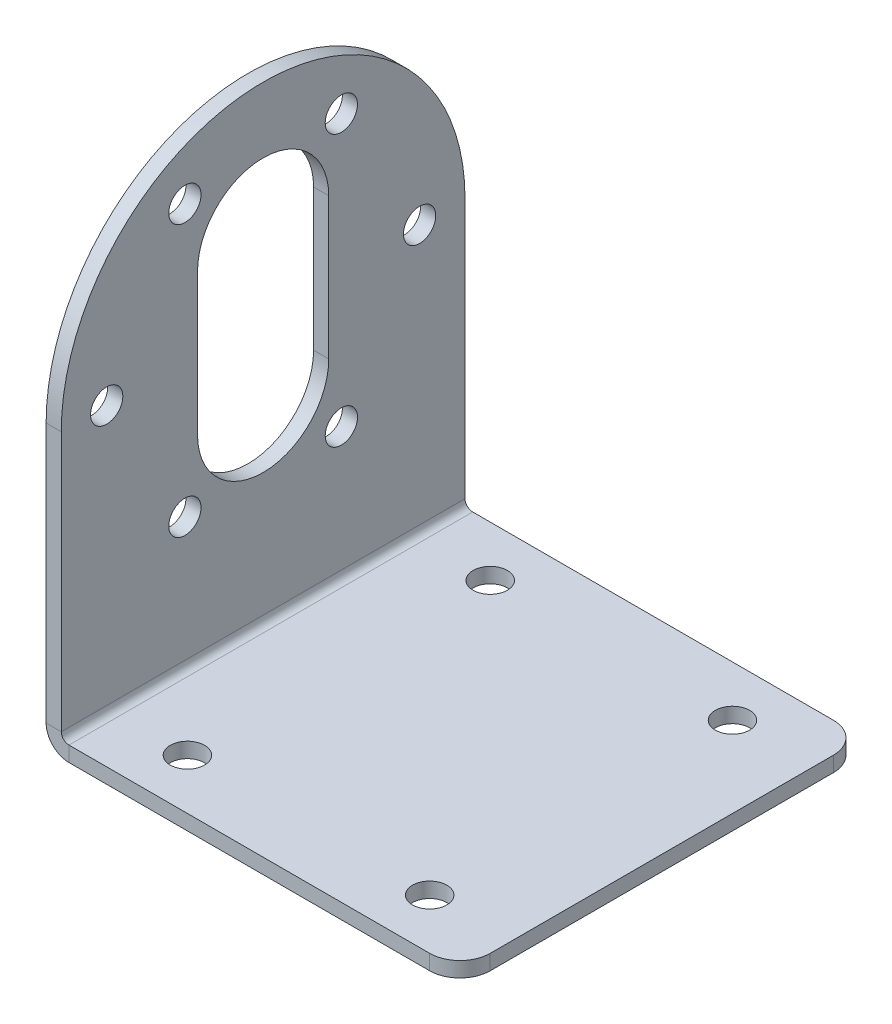
ISO-10303-21;
HEADER;
FILE_DESCRIPTION(('STEP AP214'),'2;1');
FILE_NAME('part.step','',(''),(''),'','','');
FILE_SCHEMA(('AUTOMOTIVE_DESIGN { 1 0 10303 214 1 1 1 1 }'));
ENDSEC;
DATA;
#1=APPLICATION_CONTEXT('core data for automotive mechanical design processes');
#2=APPLICATION_PROTOCOL_DEFINITION('international standard','automotive_design',2000,#1);
#3=PRODUCT_CONTEXT('',#1,'mechanical');
#4=PRODUCT('Part','Part','',(#3));
#5=PRODUCT_RELATED_PRODUCT_CATEGORY('part','',(#4));
#6=PRODUCT_DEFINITION_FORMATION('','',#4);
#7=PRODUCT_DEFINITION_CONTEXT('part definition',#1,'design');
#8=PRODUCT_DEFINITION('design','',#6,#7);
#9=PRODUCT_DEFINITION_SHAPE('','',#8);
#10=(LENGTH_UNIT() NAMED_UNIT(*) SI_UNIT(.MILLI.,.METRE.));
#11=(NAMED_UNIT(*) PLANE_ANGLE_UNIT() SI_UNIT($,.RADIAN.));
#12=(NAMED_UNIT(*) SI_UNIT($,.STERADIAN.) SOLID_ANGLE_UNIT());
#13=UNCERTAINTY_MEASURE_WITH_UNIT(LENGTH_MEASURE(1.E-05),#10,'distance_accuracy_value','');
#14=(GEOMETRIC_REPRESENTATION_CONTEXT(3) GLOBAL_UNCERTAINTY_ASSIGNED_CONTEXT((#13)) GLOBAL_UNIT_ASSIGNED_CONTEXT((#10,
#11,#12)) REPRESENTATION_CONTEXT('',''));
#15=CARTESIAN_POINT('',(0.,0.,0.));
#16=DIRECTION('',(0.,0.,1.));
#17=DIRECTION('',(1.,0.,0.));
#18=AXIS2_PLACEMENT_3D('',#15,#16,#17);
#19=CARTESIAN_POINT('',(0.,0.,0.));
#20=DIRECTION('',(1.,0.,0.));
#21=DIRECTION('',(0.,0.,-1.));
#22=AXIS2_PLACEMENT_3D('',#19,#20,#21);
#23=PLANE('',#22);
#24=DIRECTION('',(0.,-1.,0.));
#25=VECTOR('',#24,1.);
#26=CARTESIAN_POINT('',(0.,7.,-6.5));
#27=LINE('',#26,#25);
#28=CARTESIAN_POINT('',(0.,7.,-6.5));
#29=VERTEX_POINT('',#28);
#30=CARTESIAN_POINT('',(0.,-7.,-6.5));
#31=VERTEX_POINT('',#30);
#32=EDGE_CURVE('E155',#29,#31,#27,.T.);
#33=ORIENTED_EDGE('',*,*,#32,.F.);
#34=CARTESIAN_POINT('',(0.,7.,0.));
#35=DIRECTION('',(-1.,0.,0.));
#36=DIRECTION('',(0.,0.,1.));
#37=AXIS2_PLACEMENT_3D('',#34,#35,#36);
#38=CIRCLE('',#37,6.5);
#39=CARTESIAN_POINT('',(0.,7.,6.5));
#40=VERTEX_POINT('',#39);
#41=EDGE_CURVE('E160',#40,#29,#38,.T.);
#42=ORIENTED_EDGE('',*,*,#41,.F.);
#43=DIRECTION('',(0.,1.,0.));
#44=VECTOR('',#43,1.);
#45=CARTESIAN_POINT('',(0.,7.,6.5));
#46=LINE('',#45,#44);
#47=CARTESIAN_POINT('',(0.,-7.,6.5));
#48=VERTEX_POINT('',#47);
#49=EDGE_CURVE('E164',#48,#40,#46,.T.);
#50=ORIENTED_EDGE('',*,*,#49,.F.);
#51=CARTESIAN_POINT('',(0.,-7.,0.));
#52=DIRECTION('',(-1.,0.,0.));
#53=DIRECTION('',(0.,0.,1.));
#54=AXIS2_PLACEMENT_3D('',#51,#52,#53);
#55=CIRCLE('',#54,6.5);
#56=EDGE_CURVE('E144',#31,#48,#55,.T.);
#57=ORIENTED_EDGE('',*,*,#56,.F.);
#58=EDGE_LOOP('',(#33,#42,#50,#57));
#59=FACE_BOUND('',#58,.T.);
#60=CARTESIAN_POINT('',(0.,-13.4233937586589,7.74999999999988));
#61=DIRECTION('',(-1.,0.,0.));
#62=DIRECTION('',(0.,0.,1.));
#63=AXIS2_PLACEMENT_3D('',#60,#61,#62);
#64=CIRCLE('',#63,1.6);
#65=CARTESIAN_POINT('',(0.,-13.4233937586589,9.34999999999988));
#66=VERTEX_POINT('',#65);
#67=EDGE_CURVE('E179',#66,#66,#64,.T.);
#68=ORIENTED_EDGE('',*,*,#67,.F.);
#69=EDGE_LOOP('',(#68));
#70=FACE_BOUND('',#69,.T.);
#71=CARTESIAN_POINT('',(0.,13.4233937586588,7.75000000000006));
#72=DIRECTION('',(-1.,0.,0.));
#73=DIRECTION('',(0.,0.,1.));
#74=AXIS2_PLACEMENT_3D('',#71,#72,#73);
#75=CIRCLE('',#74,1.6);
#76=CARTESIAN_POINT('',(0.,13.4233937586588,9.35000000000006));
#77=VERTEX_POINT('',#76);
#78=EDGE_CURVE('E191',#77,#77,#75,.T.);
#79=ORIENTED_EDGE('',*,*,#78,.F.);
#80=EDGE_LOOP('',(#79));
#81=FACE_BOUND('',#80,.T.);
#82=CARTESIAN_POINT('',(0.,13.4233937586588,-7.74999999999997));
#83=DIRECTION('',(-1.,0.,0.));
#84=DIRECTION('',(0.,0.,1.));
#85=AXIS2_PLACEMENT_3D('',#82,#83,#84);
#86=CIRCLE('',#85,1.6);
#87=CARTESIAN_POINT('',(0.,13.4233937586588,-6.14999999999997));
#88=VERTEX_POINT('',#87);
#89=EDGE_CURVE('E197',#88,#88,#86,.T.);
#90=ORIENTED_EDGE('',*,*,#89,.F.);
#91=EDGE_LOOP('',(#90));
#92=FACE_BOUND('',#91,.T.);
#93=CARTESIAN_POINT('',(0.,0.,-15.5));
#94=DIRECTION('',(-1.,0.,0.));
#95=DIRECTION('',(0.,0.,1.));
#96=AXIS2_PLACEMENT_3D('',#93,#94,#95);
#97=CIRCLE('',#96,1.6);
#98=CARTESIAN_POINT('',(0.,0.,-13.9));
#99=VERTEX_POINT('',#98);
#100=EDGE_CURVE('E201',#99,#99,#97,.T.);
#101=ORIENTED_EDGE('',*,*,#100,.F.);
#102=EDGE_LOOP('',(#101));
#103=FACE_BOUND('',#102,.T.);
#104=DIRECTION('',(0.,1.,0.));
#105=VECTOR('',#104,1.);
#106=CARTESIAN_POINT('',(0.,0.,-20.));
#107=LINE('',#106,#105);
#108=CARTESIAN_POINT('',(0.,-25.738,-20.));
#109=VERTEX_POINT('',#108);
#110=CARTESIAN_POINT('',(0.,0.,-20.));
#111=VERTEX_POINT('',#110);
#112=EDGE_CURVE('E222',#109,#111,#107,.T.);
#113=ORIENTED_EDGE('',*,*,#112,.F.);
#114=DIRECTION('',(0.,0.,-1.));
#115=VECTOR('',#114,1.);
#116=CARTESIAN_POINT('',(0.,-25.738,0.));
#117=LINE('',#116,#115);
#118=CARTESIAN_POINT('',(0.,-25.738,20.));
#119=VERTEX_POINT('',#118);
#120=EDGE_CURVE('E228',#109,#119,#117,.F.);
#121=ORIENTED_EDGE('',*,*,#120,.T.);
#122=DIRECTION('',(0.,-1.,0.));
#123=VECTOR('',#122,1.);
#124=CARTESIAN_POINT('',(0.,0.,20.));
#125=LINE('',#124,#123);
#126=CARTESIAN_POINT('',(0.,0.,20.));
#127=VERTEX_POINT('',#126);
#128=EDGE_CURVE('E216',#127,#119,#125,.T.);
#129=ORIENTED_EDGE('',*,*,#128,.F.);
#130=CARTESIAN_POINT('',(0.,0.,0.));
#131=DIRECTION('',(1.,0.,0.));
#132=DIRECTION('',(0.,0.,-1.));
#133=AXIS2_PLACEMENT_3D('',#130,#131,#132);
#134=CIRCLE('',#133,20.);
#135=EDGE_CURVE('E219',#111,#127,#134,.T.);
#136=ORIENTED_EDGE('',*,*,#135,.F.);
#137=EDGE_LOOP('',(#113,#121,#129,#136));
#138=FACE_BOUND('',#137,.T.);
#139=CARTESIAN_POINT('',(0.,0.,15.5));
#140=DIRECTION('',(-1.,0.,0.));
#141=DIRECTION('',(0.,0.,1.));
#142=AXIS2_PLACEMENT_3D('',#139,#140,#141);
#143=CIRCLE('',#142,1.6);
#144=CARTESIAN_POINT('',(0.,0.,17.1));
#145=VERTEX_POINT('',#144);
#146=EDGE_CURVE('E185',#145,#145,#143,.T.);
#147=ORIENTED_EDGE('',*,*,#146,.F.);
#148=EDGE_LOOP('',(#147));
#149=FACE_BOUND('',#148,.T.);
#150=CARTESIAN_POINT('',(0.,-13.4233937586587,-7.75000000000016));
#151=DIRECTION('',(-1.,0.,0.));
#152=DIRECTION('',(0.,0.,1.));
#153=AXIS2_PLACEMENT_3D('',#150,#151,#152);
#154=CIRCLE('',#153,1.6);
#155=CARTESIAN_POINT('',(0.,-13.4233937586587,-6.15000000000016));
#156=VERTEX_POINT('',#155);
#157=EDGE_CURVE('E171',#156,#156,#154,.T.);
#158=ORIENTED_EDGE('',*,*,#157,.F.);
#159=EDGE_LOOP('',(#158));
#160=FACE_BOUND('',#159,.T.);
#161=ADVANCED_FACE('F38',(#59,#70,#81,#92,#103,#138,#149,#160),#23,.F.);
#162=CARTESIAN_POINT('',(1.5,-28.,-20.));
#163=DIRECTION('',(0.,0.,-1.));
#164=DIRECTION('',(-1.,0.,0.));
#165=AXIS2_PLACEMENT_3D('',#162,#163,#164);
#166=PLANE('',#165);
#167=DIRECTION('',(1.,0.,0.));
#168=VECTOR('',#167,1.);
#169=CARTESIAN_POINT('',(1.5,-26.5,-20.));
#170=LINE('',#169,#168);
#171=CARTESIAN_POINT('',(38.,-26.5,-20.));
#172=VERTEX_POINT('',#171);
#173=CARTESIAN_POINT('',(2.262,-26.5,-20.));
#174=VERTEX_POINT('',#173);
#175=EDGE_CURVE('E256',#172,#174,#170,.F.);
#176=ORIENTED_EDGE('',*,*,#175,.F.);
#177=DIRECTION('',(0.,1.,0.));
#178=VECTOR('',#177,1.);
#179=CARTESIAN_POINT('',(38.,-28.,-20.));
#180=LINE('',#179,#178);
#181=CARTESIAN_POINT('',(38.,-28.,-20.));
#182=VERTEX_POINT('',#181);
#183=EDGE_CURVE('E285',#172,#182,#180,.F.);
#184=ORIENTED_EDGE('',*,*,#183,.T.);
#185=DIRECTION('',(-1.,0.,0.));
#186=VECTOR('',#185,1.);
#187=CARTESIAN_POINT('',(1.5,-28.,-20.));
#188=LINE('',#187,#186);
#189=CARTESIAN_POINT('',(2.262,-28.,-20.));
#190=VERTEX_POINT('',#189);
#191=EDGE_CURVE('E208',#182,#190,#188,.T.);
#192=ORIENTED_EDGE('',*,*,#191,.T.);
#193=DIRECTION('',(0.,-1.,0.));
#194=VECTOR('',#193,1.);
#195=CARTESIAN_POINT('',(2.262,-28.,-20.));
#196=LINE('',#195,#194);
#197=EDGE_CURVE('E272',#174,#190,#196,.T.);
#198=ORIENTED_EDGE('',*,*,#197,.F.);
#199=EDGE_LOOP('',(#176,#184,#192,#198));
#200=FACE_BOUND('',#199,.T.);
#201=ADVANCED_FACE('F306',(#200),#166,.T.);
#202=CARTESIAN_POINT('',(41.,-28.,20.));
#203=DIRECTION('',(-1.,0.,0.));
#204=DIRECTION('',(0.,0.,1.));
#205=AXIS2_PLACEMENT_3D('',#202,#203,#204);
#206=PLANE('',#205);
#207=DIRECTION('',(0.,0.,1.));
#208=VECTOR('',#207,1.);
#209=CARTESIAN_POINT('',(41.,-28.,20.));
#210=LINE('',#209,#208);
#211=CARTESIAN_POINT('',(41.,-28.,-17.));
#212=VERTEX_POINT('',#211);
#213=CARTESIAN_POINT('',(41.,-28.,17.));
#214=VERTEX_POINT('',#213);
#215=EDGE_CURVE('E210',#212,#214,#210,.T.);
#216=ORIENTED_EDGE('',*,*,#215,.F.);
#217=DIRECTION('',(0.,-1.,0.));
#218=VECTOR('',#217,1.);
#219=CARTESIAN_POINT('',(41.,-28.,-17.));
#220=LINE('',#219,#218);
#221=CARTESIAN_POINT('',(41.,-26.5,-17.));
#222=VERTEX_POINT('',#221);
#223=EDGE_CURVE('E295',#212,#222,#220,.F.);
#224=ORIENTED_EDGE('',*,*,#223,.T.);
#225=DIRECTION('',(0.,0.,1.));
#226=VECTOR('',#225,1.);
#227=CARTESIAN_POINT('',(41.,-26.5,20.));
#228=LINE('',#227,#226);
#229=CARTESIAN_POINT('',(41.,-26.5,17.));
#230=VERTEX_POINT('',#229);
#231=EDGE_CURVE('E258',#222,#230,#228,.T.);
#232=ORIENTED_EDGE('',*,*,#231,.T.);
#233=DIRECTION('',(0.,1.,0.));
#234=VECTOR('',#233,1.);
#235=CARTESIAN_POINT('',(41.,-28.,17.));
#236=LINE('',#235,#234);
#237=EDGE_CURVE('E292',#230,#214,#236,.F.);
#238=ORIENTED_EDGE('',*,*,#237,.T.);
#239=EDGE_LOOP('',(#216,#224,#232,#238));
#240=FACE_BOUND('',#239,.T.);
#241=ADVANCED_FACE('F313',(#240),#206,.F.);
#242=CARTESIAN_POINT('',(1.5,-28.,20.));
#243=DIRECTION('',(0.,0.,-1.));
#244=DIRECTION('',(-1.,0.,0.));
#245=AXIS2_PLACEMENT_3D('',#242,#243,#244);
#246=PLANE('',#245);
#247=DIRECTION('',(-1.,0.,0.));
#248=VECTOR('',#247,1.);
#249=CARTESIAN_POINT('',(1.5,-28.,20.));
#250=LINE('',#249,#248);
#251=CARTESIAN_POINT('',(38.,-28.,20.));
#252=VERTEX_POINT('',#251);
#253=CARTESIAN_POINT('',(2.262,-28.,20.));
#254=VERTEX_POINT('',#253);
#255=EDGE_CURVE('E214',#252,#254,#250,.T.);
#256=ORIENTED_EDGE('',*,*,#255,.F.);
#257=DIRECTION('',(0.,1.,0.));
#258=VECTOR('',#257,1.);
#259=CARTESIAN_POINT('',(38.,-28.,20.));
#260=LINE('',#259,#258);
#261=CARTESIAN_POINT('',(38.,-26.5,20.));
#262=VERTEX_POINT('',#261);
#263=EDGE_CURVE('E11',#252,#262,#260,.T.);
#264=ORIENTED_EDGE('',*,*,#263,.T.);
#265=DIRECTION('',(1.,0.,0.));
#266=VECTOR('',#265,1.);
#267=CARTESIAN_POINT('',(1.5,-26.5,20.));
#268=LINE('',#267,#266);
#269=CARTESIAN_POINT('',(2.262,-26.5,20.));
#270=VERTEX_POINT('',#269);
#271=EDGE_CURVE('E252',#262,#270,#268,.F.);
#272=ORIENTED_EDGE('',*,*,#271,.T.);
#273=DIRECTION('',(0.,-1.,0.));
#274=VECTOR('',#273,1.);
#275=CARTESIAN_POINT('',(2.262,-28.,20.));
#276=LINE('',#275,#274);
#277=EDGE_CURVE('E269',#270,#254,#276,.T.);
#278=ORIENTED_EDGE('',*,*,#277,.T.);
#279=EDGE_LOOP('',(#256,#264,#272,#278));
#280=FACE_BOUND('',#279,.T.);
#281=ADVANCED_FACE('F316',(#280),#246,.F.);
#282=CARTESIAN_POINT('',(2.262,-25.738,20.));
#283=DIRECTION('',(0.,0.,1.));
#284=DIRECTION('',(0.,-1.,0.));
#285=AXIS2_PLACEMENT_3D('',#282,#283,#284);
#286=PLANE('',#285);
#287=ORIENTED_EDGE('',*,*,#277,.F.);
#288=CARTESIAN_POINT('',(2.262,-25.738,20.));
#289=DIRECTION('',(0.,0.,-1.));
#290=DIRECTION('',(-1.,0.,0.));
#291=AXIS2_PLACEMENT_3D('',#288,#289,#290);
#292=CIRCLE('',#291,0.762);
#293=CARTESIAN_POINT('',(1.5,-25.738,20.));
#294=VERTEX_POINT('',#293);
#295=EDGE_CURVE('E253',#270,#294,#292,.T.);
#296=ORIENTED_EDGE('',*,*,#295,.T.);
#297=DIRECTION('',(-1.,0.,0.));
#298=VECTOR('',#297,1.);
#299=CARTESIAN_POINT('',(0.,-25.738,20.));
#300=LINE('',#299,#298);
#301=EDGE_CURVE('E267',#294,#119,#300,.T.);
#302=ORIENTED_EDGE('',*,*,#301,.T.);
#303=CARTESIAN_POINT('',(2.262,-25.738,20.));
#304=DIRECTION('',(0.,0.,-1.));
#305=DIRECTION('',(0.,1.,0.));
#306=AXIS2_PLACEMENT_3D('',#303,#304,#305);
#307=CIRCLE('',#306,2.262);
#308=EDGE_CURVE('E211',#254,#119,#307,.T.);
#309=ORIENTED_EDGE('',*,*,#308,.F.);
#310=EDGE_LOOP('',(#287,#296,#302,#309));
#311=FACE_BOUND('',#310,.T.);
#312=ADVANCED_FACE('F321',(#311),#286,.T.);
#313=CARTESIAN_POINT('',(0.,0.,20.));
#314=DIRECTION('',(0.,0.,1.));
#315=DIRECTION('',(0.,-1.,0.));
#316=AXIS2_PLACEMENT_3D('',#313,#314,#315);
#317=PLANE('',#316);
#318=ORIENTED_EDGE('',*,*,#301,.F.);
#319=DIRECTION('',(0.,1.,0.));
#320=VECTOR('',#319,1.);
#321=CARTESIAN_POINT('',(1.5,0.,20.));
#322=LINE('',#321,#320);
#323=CARTESIAN_POINT('',(1.5,0.,20.));
#324=VERTEX_POINT('',#323);
#325=EDGE_CURVE('E249',#324,#294,#322,.F.);
#326=ORIENTED_EDGE('',*,*,#325,.F.);
#327=DIRECTION('',(-1.,0.,0.));
#328=VECTOR('',#327,1.);
#329=CARTESIAN_POINT('',(0.,0.,20.));
#330=LINE('',#329,#328);
#331=EDGE_CURVE('E265',#324,#127,#330,.T.);
#332=ORIENTED_EDGE('',*,*,#331,.T.);
#333=ORIENTED_EDGE('',*,*,#128,.T.);
#334=EDGE_LOOP('',(#318,#326,#332,#333));
#335=FACE_BOUND('',#334,.T.);
#336=ADVANCED_FACE('F504',(#335),#317,.T.);
#337=CARTESIAN_POINT('',(0.,0.,0.));
#338=DIRECTION('',(1.,0.,0.));
#339=DIRECTION('',(0.,0.,-1.));
#340=AXIS2_PLACEMENT_3D('',#337,#338,#339);
#341=CYLINDRICAL_SURFACE('',#340,20.);
#342=ORIENTED_EDGE('',*,*,#331,.F.);
#343=CARTESIAN_POINT('',(1.5,0.,0.));
#344=DIRECTION('',(1.,0.,0.));
#345=DIRECTION('',(0.,0.,-1.));
#346=AXIS2_PLACEMENT_3D('',#343,#344,#345);
#347=CIRCLE('',#346,20.);
#348=CARTESIAN_POINT('',(1.5,0.,-20.));
#349=VERTEX_POINT('',#348);
#350=EDGE_CURVE('E246',#349,#324,#347,.T.);
#351=ORIENTED_EDGE('',*,*,#350,.F.);
#352=DIRECTION('',(-1.,0.,0.));
#353=VECTOR('',#352,1.);
#354=CARTESIAN_POINT('',(0.,0.,-20.));
#355=LINE('',#354,#353);
#356=EDGE_CURVE('E263',#349,#111,#355,.T.);
#357=ORIENTED_EDGE('',*,*,#356,.T.);
#358=ORIENTED_EDGE('',*,*,#135,.T.);
#359=EDGE_LOOP('',(#342,#351,#357,#358));
#360=FACE_BOUND('',#359,.T.);
#361=ADVANCED_FACE('F496',(#360),#341,.T.);
#362=CARTESIAN_POINT('',(0.,0.,-20.));
#363=DIRECTION('',(0.,0.,-1.));
#364=DIRECTION('',(0.,1.,0.));
#365=AXIS2_PLACEMENT_3D('',#362,#363,#364);
#366=PLANE('',#365);
#367=ORIENTED_EDGE('',*,*,#356,.F.);
#368=DIRECTION('',(0.,1.,0.));
#369=VECTOR('',#368,1.);
#370=CARTESIAN_POINT('',(1.5,0.,-20.));
#371=LINE('',#370,#369);
#372=CARTESIAN_POINT('',(1.5,-25.738,-20.));
#373=VERTEX_POINT('',#372);
#374=EDGE_CURVE('E243',#373,#349,#371,.T.);
#375=ORIENTED_EDGE('',*,*,#374,.F.);
#376=DIRECTION('',(-1.,0.,0.));
#377=VECTOR('',#376,1.);
#378=CARTESIAN_POINT('',(0.,-25.738,-20.));
#379=LINE('',#378,#377);
#380=EDGE_CURVE('E231',#373,#109,#379,.T.);
#381=ORIENTED_EDGE('',*,*,#380,.T.);
#382=ORIENTED_EDGE('',*,*,#112,.T.);
#383=EDGE_LOOP('',(#367,#375,#381,#382));
#384=FACE_BOUND('',#383,.T.);
#385=ADVANCED_FACE('F335',(#384),#366,.T.);
#386=CARTESIAN_POINT('',(2.262,-25.738,-20.));
#387=DIRECTION('',(0.,0.,1.));
#388=DIRECTION('',(0.,-1.,0.));
#389=AXIS2_PLACEMENT_3D('',#386,#387,#388);
#390=PLANE('',#389);
#391=CARTESIAN_POINT('',(2.262,-25.738,-20.));
#392=DIRECTION('',(0.,0.,-1.));
#393=DIRECTION('',(-1.,0.,0.));
#394=AXIS2_PLACEMENT_3D('',#391,#392,#393);
#395=CIRCLE('',#394,0.762);
#396=EDGE_CURVE('E207',#373,#174,#395,.F.);
#397=ORIENTED_EDGE('',*,*,#396,.T.);
#398=ORIENTED_EDGE('',*,*,#197,.T.);
#399=CARTESIAN_POINT('',(2.262,-25.738,-20.));
#400=DIRECTION('',(0.,0.,-1.));
#401=DIRECTION('',(0.,1.,0.));
#402=AXIS2_PLACEMENT_3D('',#399,#400,#401);
#403=CIRCLE('',#402,2.262);
#404=EDGE_CURVE('E232',#109,#190,#403,.F.);
#405=ORIENTED_EDGE('',*,*,#404,.F.);
#406=ORIENTED_EDGE('',*,*,#380,.F.);
#407=EDGE_LOOP('',(#397,#398,#405,#406));
#408=FACE_BOUND('',#407,.T.);
#409=ADVANCED_FACE('F328',(#408),#390,.F.);
#410=CARTESIAN_POINT('',(1.5,-28.,20.));
#411=DIRECTION('',(0.,1.,0.));
#412=DIRECTION('',(0.,0.,1.));
#413=AXIS2_PLACEMENT_3D('',#410,#411,#412);
#414=PLANE('',#413);
#415=CARTESIAN_POINT('',(9.00000000000001,-28.,-15.));
#416=DIRECTION('',(0.,1.,0.));
#417=DIRECTION('',(0.,0.,1.));
#418=AXIS2_PLACEMENT_3D('',#415,#416,#417);
#419=CIRCLE('',#418,1.7);
#420=CARTESIAN_POINT('',(9.00000000000001,-28.,-13.3));
#421=VERTEX_POINT('',#420);
#422=EDGE_CURVE('E447',#421,#421,#419,.T.);
#423=ORIENTED_EDGE('',*,*,#422,.T.);
#424=EDGE_LOOP('',(#423));
#425=FACE_BOUND('',#424,.T.);
#426=CARTESIAN_POINT('',(9.00000000000001,-28.,15.));
#427=DIRECTION('',(0.,1.,0.));
#428=DIRECTION('',(0.,0.,1.));
#429=AXIS2_PLACEMENT_3D('',#426,#427,#428);
#430=CIRCLE('',#429,1.7);
#431=CARTESIAN_POINT('',(9.00000000000001,-28.,16.7));
#432=VERTEX_POINT('',#431);
#433=EDGE_CURVE('E451',#432,#432,#430,.T.);
#434=ORIENTED_EDGE('',*,*,#433,.T.);
#435=EDGE_LOOP('',(#434));
#436=FACE_BOUND('',#435,.T.);
#437=CARTESIAN_POINT('',(33.,-28.,15.));
#438=DIRECTION('',(0.,1.,0.));
#439=DIRECTION('',(0.,0.,1.));
#440=AXIS2_PLACEMENT_3D('',#437,#438,#439);
#441=CIRCLE('',#440,1.7);
#442=CARTESIAN_POINT('',(33.,-28.,16.7));
#443=VERTEX_POINT('',#442);
#444=EDGE_CURVE('E463',#443,#443,#441,.T.);
#445=ORIENTED_EDGE('',*,*,#444,.T.);
#446=EDGE_LOOP('',(#445));
#447=FACE_BOUND('',#446,.T.);
#448=CARTESIAN_POINT('',(33.,-28.,-15.));
#449=DIRECTION('',(0.,1.,0.));
#450=DIRECTION('',(0.,0.,1.));
#451=AXIS2_PLACEMENT_3D('',#448,#449,#450);
#452=CIRCLE('',#451,1.7);
#453=CARTESIAN_POINT('',(33.,-28.,-13.3));
#454=VERTEX_POINT('',#453);
#455=EDGE_CURVE('E469',#454,#454,#452,.T.);
#456=ORIENTED_EDGE('',*,*,#455,.T.);
#457=EDGE_LOOP('',(#456));
#458=FACE_BOUND('',#457,.T.);
#459=ORIENTED_EDGE('',*,*,#191,.F.);
#460=CARTESIAN_POINT('',(38.,-28.,-17.));
#461=DIRECTION('',(0.,1.,0.));
#462=DIRECTION('',(0.,0.,1.));
#463=AXIS2_PLACEMENT_3D('',#460,#461,#462);
#464=CIRCLE('',#463,3.);
#465=EDGE_CURVE('E290',#182,#212,#464,.F.);
#466=ORIENTED_EDGE('',*,*,#465,.T.);
#467=ORIENTED_EDGE('',*,*,#215,.T.);
#468=CARTESIAN_POINT('',(38.,-28.,17.));
#469=DIRECTION('',(0.,1.,0.));
#470=DIRECTION('',(0.,0.,1.));
#471=AXIS2_PLACEMENT_3D('',#468,#469,#470);
#472=CIRCLE('',#471,3.);
#473=EDGE_CURVE('E288',#214,#252,#472,.F.);
#474=ORIENTED_EDGE('',*,*,#473,.T.);
#475=ORIENTED_EDGE('',*,*,#255,.T.);
#476=DIRECTION('',(0.,0.,-1.));
#477=VECTOR('',#476,1.);
#478=CARTESIAN_POINT('',(2.262,-28.,20.));
#479=LINE('',#478,#477);
#480=EDGE_CURVE('E225',#254,#190,#479,.T.);
#481=ORIENTED_EDGE('',*,*,#480,.T.);
#482=EDGE_LOOP('',(#459,#466,#467,#474,#475,#481));
#483=FACE_BOUND('',#482,.T.);
#484=ADVANCED_FACE('F311',(#425,#436,#447,#458,#483),#414,.F.);
#485=CARTESIAN_POINT('',(2.262,-25.738,20.));
#486=DIRECTION('',(0.,0.,-1.));
#487=DIRECTION('',(-1.,0.,0.));
#488=AXIS2_PLACEMENT_3D('',#485,#486,#487);
#489=CYLINDRICAL_SURFACE('',#488,2.262);
#490=ORIENTED_EDGE('',*,*,#308,.T.);
#491=ORIENTED_EDGE('',*,*,#120,.F.);
#492=ORIENTED_EDGE('',*,*,#404,.T.);
#493=ORIENTED_EDGE('',*,*,#480,.F.);
#494=EDGE_LOOP('',(#490,#491,#492,#493));
#495=FACE_BOUND('',#494,.T.);
#496=ADVANCED_FACE('F324',(#495),#489,.T.);
#497=CARTESIAN_POINT('',(1.5,0.,0.));
#498=DIRECTION('',(1.,0.,0.));
#499=DIRECTION('',(0.,0.,-1.));
#500=AXIS2_PLACEMENT_3D('',#497,#498,#499);
#501=PLANE('',#500);
#502=CARTESIAN_POINT('',(1.5,7.,0.));
#503=DIRECTION('',(1.,0.,0.));
#504=DIRECTION('',(0.,0.,-1.));
#505=AXIS2_PLACEMENT_3D('',#502,#503,#504);
#506=CIRCLE('',#505,6.5);
#507=CARTESIAN_POINT('',(1.50000000000002,7.,-6.5));
#508=VERTEX_POINT('',#507);
#509=CARTESIAN_POINT('',(1.50000000000002,7.,6.5));
#510=VERTEX_POINT('',#509);
#511=EDGE_CURVE('E283',#508,#510,#506,.T.);
#512=ORIENTED_EDGE('',*,*,#511,.F.);
#513=DIRECTION('',(0.,1.,0.));
#514=VECTOR('',#513,1.);
#515=CARTESIAN_POINT('',(1.5,0.,-6.5));
#516=LINE('',#515,#514);
#517=CARTESIAN_POINT('',(1.5,-7.,-6.5));
#518=VERTEX_POINT('',#517);
#519=EDGE_CURVE('E275',#518,#508,#516,.T.);
#520=ORIENTED_EDGE('',*,*,#519,.F.);
#521=CARTESIAN_POINT('',(1.5,-7.,0.));
#522=DIRECTION('',(1.,0.,0.));
#523=DIRECTION('',(0.,0.,-1.));
#524=AXIS2_PLACEMENT_3D('',#521,#522,#523);
#525=CIRCLE('',#524,6.5);
#526=CARTESIAN_POINT('',(1.50000000000002,-7.,6.5));
#527=VERTEX_POINT('',#526);
#528=EDGE_CURVE('E147',#527,#518,#525,.T.);
#529=ORIENTED_EDGE('',*,*,#528,.F.);
#530=DIRECTION('',(0.,-1.,0.));
#531=VECTOR('',#530,1.);
#532=CARTESIAN_POINT('',(1.5,0.,6.5));
#533=LINE('',#532,#531);
#534=EDGE_CURVE('E281',#510,#527,#533,.T.);
#535=ORIENTED_EDGE('',*,*,#534,.F.);
#536=EDGE_LOOP('',(#512,#520,#529,#535));
#537=FACE_BOUND('',#536,.T.);
#538=CARTESIAN_POINT('',(1.5,-13.4233937586587,-7.75000000000016));
#539=DIRECTION('',(1.,0.,0.));
#540=DIRECTION('',(0.,0.,-1.));
#541=AXIS2_PLACEMENT_3D('',#538,#539,#540);
#542=CIRCLE('',#541,1.59999999999999);
#543=CARTESIAN_POINT('',(1.5,-13.4233937586587,-9.35000000000015));
#544=VERTEX_POINT('',#543);
#545=EDGE_CURVE('E176',#544,#544,#542,.T.);
#546=ORIENTED_EDGE('',*,*,#545,.F.);
#547=EDGE_LOOP('',(#546));
#548=FACE_BOUND('',#547,.T.);
#549=CARTESIAN_POINT('',(1.5,-13.4233937586589,7.74999999999988));
#550=DIRECTION('',(1.,0.,0.));
#551=DIRECTION('',(0.,0.,-1.));
#552=AXIS2_PLACEMENT_3D('',#549,#550,#551);
#553=CIRCLE('',#552,1.59999999999999);
#554=CARTESIAN_POINT('',(1.5,-13.4233937586589,6.14999999999988));
#555=VERTEX_POINT('',#554);
#556=EDGE_CURVE('E182',#555,#555,#553,.T.);
#557=ORIENTED_EDGE('',*,*,#556,.F.);
#558=EDGE_LOOP('',(#557));
#559=FACE_BOUND('',#558,.T.);
#560=CARTESIAN_POINT('',(1.5,0.,15.5));
#561=DIRECTION('',(1.,0.,0.));
#562=DIRECTION('',(0.,0.,-1.));
#563=AXIS2_PLACEMENT_3D('',#560,#561,#562);
#564=CIRCLE('',#563,1.59999999999999);
#565=CARTESIAN_POINT('',(1.5,0.,13.9));
#566=VERTEX_POINT('',#565);
#567=EDGE_CURVE('E188',#566,#566,#564,.T.);
#568=ORIENTED_EDGE('',*,*,#567,.F.);
#569=EDGE_LOOP('',(#568));
#570=FACE_BOUND('',#569,.T.);
#571=CARTESIAN_POINT('',(1.5,13.4233937586588,7.75000000000006));
#572=DIRECTION('',(1.,0.,0.));
#573=DIRECTION('',(0.,0.,-1.));
#574=AXIS2_PLACEMENT_3D('',#571,#572,#573);
#575=CIRCLE('',#574,1.59999999999999);
#576=CARTESIAN_POINT('',(1.5,13.4233937586588,6.15000000000007));
#577=VERTEX_POINT('',#576);
#578=EDGE_CURVE('E194',#577,#577,#575,.T.);
#579=ORIENTED_EDGE('',*,*,#578,.F.);
#580=EDGE_LOOP('',(#579));
#581=FACE_BOUND('',#580,.T.);
#582=CARTESIAN_POINT('',(1.5,13.4233937586588,-7.74999999999997));
#583=DIRECTION('',(1.,0.,0.));
#584=DIRECTION('',(0.,0.,-1.));
#585=AXIS2_PLACEMENT_3D('',#582,#583,#584);
#586=CIRCLE('',#585,1.59999999999999);
#587=CARTESIAN_POINT('',(1.5,13.4233937586588,-9.34999999999996));
#588=VERTEX_POINT('',#587);
#589=EDGE_CURVE('E200',#588,#588,#586,.T.);
#590=ORIENTED_EDGE('',*,*,#589,.F.);
#591=EDGE_LOOP('',(#590));
#592=FACE_BOUND('',#591,.T.);
#593=CARTESIAN_POINT('',(1.5,0.,-15.5));
#594=DIRECTION('',(1.,0.,0.));
#595=DIRECTION('',(0.,0.,-1.));
#596=AXIS2_PLACEMENT_3D('',#593,#594,#595);
#597=CIRCLE('',#596,1.59999999999999);
#598=CARTESIAN_POINT('',(1.5,0.,-17.1));
#599=VERTEX_POINT('',#598);
#600=EDGE_CURVE('E204',#599,#599,#597,.T.);
#601=ORIENTED_EDGE('',*,*,#600,.F.);
#602=EDGE_LOOP('',(#601));
#603=FACE_BOUND('',#602,.T.);
#604=ORIENTED_EDGE('',*,*,#374,.T.);
#605=ORIENTED_EDGE('',*,*,#350,.T.);
#606=ORIENTED_EDGE('',*,*,#325,.T.);
#607=DIRECTION('',(0.,0.,-1.));
#608=VECTOR('',#607,1.);
#609=CARTESIAN_POINT('',(1.5,-25.738,0.));
#610=LINE('',#609,#608);
#611=EDGE_CURVE('E235',#373,#294,#610,.F.);
#612=ORIENTED_EDGE('',*,*,#611,.F.);
#613=EDGE_LOOP('',(#604,#605,#606,#612));
#614=FACE_BOUND('',#613,.T.);
#615=ADVANCED_FACE('F339',(#537,#548,#559,#570,#581,#592,#603,#614),#501,.T.);
#616=CARTESIAN_POINT('',(1.5,-26.5,20.));
#617=DIRECTION('',(0.,1.,0.));
#618=DIRECTION('',(0.,0.,1.));
#619=AXIS2_PLACEMENT_3D('',#616,#617,#618);
#620=PLANE('',#619);
#621=CARTESIAN_POINT('',(9.00000000000001,-26.5,-15.));
#622=DIRECTION('',(0.,1.,0.));
#623=DIRECTION('',(0.,0.,1.));
#624=AXIS2_PLACEMENT_3D('',#621,#622,#623);
#625=CIRCLE('',#624,1.7);
#626=CARTESIAN_POINT('',(9.00000000000001,-26.5,-13.3));
#627=VERTEX_POINT('',#626);
#628=EDGE_CURVE('E450',#627,#627,#625,.T.);
#629=ORIENTED_EDGE('',*,*,#628,.F.);
#630=EDGE_LOOP('',(#629));
#631=FACE_BOUND('',#630,.T.);
#632=CARTESIAN_POINT('',(9.00000000000001,-26.5,15.));
#633=DIRECTION('',(0.,1.,0.));
#634=DIRECTION('',(0.,0.,1.));
#635=AXIS2_PLACEMENT_3D('',#632,#633,#634);
#636=CIRCLE('',#635,1.7);
#637=CARTESIAN_POINT('',(9.00000000000001,-26.5,16.7));
#638=VERTEX_POINT('',#637);
#639=EDGE_CURVE('E454',#638,#638,#636,.T.);
#640=ORIENTED_EDGE('',*,*,#639,.F.);
#641=EDGE_LOOP('',(#640));
#642=FACE_BOUND('',#641,.T.);
#643=CARTESIAN_POINT('',(33.,-26.5,15.));
#644=DIRECTION('',(0.,1.,0.));
#645=DIRECTION('',(0.,0.,1.));
#646=AXIS2_PLACEMENT_3D('',#643,#644,#645);
#647=CIRCLE('',#646,1.7);
#648=CARTESIAN_POINT('',(33.,-26.5,16.7));
#649=VERTEX_POINT('',#648);
#650=EDGE_CURVE('E460',#649,#649,#647,.T.);
#651=ORIENTED_EDGE('',*,*,#650,.F.);
#652=EDGE_LOOP('',(#651));
#653=FACE_BOUND('',#652,.T.);
#654=CARTESIAN_POINT('',(33.,-26.5,-15.));
#655=DIRECTION('',(0.,1.,0.));
#656=DIRECTION('',(0.,0.,1.));
#657=AXIS2_PLACEMENT_3D('',#654,#655,#656);
#658=CIRCLE('',#657,1.7);
#659=CARTESIAN_POINT('',(33.,-26.5,-13.3));
#660=VERTEX_POINT('',#659);
#661=EDGE_CURVE('E466',#660,#660,#658,.T.);
#662=ORIENTED_EDGE('',*,*,#661,.F.);
#663=EDGE_LOOP('',(#662));
#664=FACE_BOUND('',#663,.T.);
#665=ORIENTED_EDGE('',*,*,#231,.F.);
#666=CARTESIAN_POINT('',(38.,-26.5,-17.));
#667=DIRECTION('',(0.,1.,0.));
#668=DIRECTION('',(0.,0.,1.));
#669=AXIS2_PLACEMENT_3D('',#666,#667,#668);
#670=CIRCLE('',#669,3.);
#671=EDGE_CURVE('E46',#222,#172,#670,.T.);
#672=ORIENTED_EDGE('',*,*,#671,.T.);
#673=ORIENTED_EDGE('',*,*,#175,.T.);
#674=DIRECTION('',(0.,0.,1.));
#675=VECTOR('',#674,1.);
#676=CARTESIAN_POINT('',(2.262,-26.5,20.));
#677=LINE('',#676,#675);
#678=EDGE_CURVE('E240',#270,#174,#677,.F.);
#679=ORIENTED_EDGE('',*,*,#678,.F.);
#680=ORIENTED_EDGE('',*,*,#271,.F.);
#681=CARTESIAN_POINT('',(38.,-26.5,17.));
#682=DIRECTION('',(0.,1.,0.));
#683=DIRECTION('',(0.,0.,1.));
#684=AXIS2_PLACEMENT_3D('',#681,#682,#683);
#685=CIRCLE('',#684,3.);
#686=EDGE_CURVE('E58',#262,#230,#685,.T.);
#687=ORIENTED_EDGE('',*,*,#686,.T.);
#688=EDGE_LOOP('',(#665,#672,#673,#679,#680,#687));
#689=FACE_BOUND('',#688,.T.);
#690=ADVANCED_FACE('F299',(#631,#642,#653,#664,#689),#620,.T.);
#691=CARTESIAN_POINT('',(2.262,-25.738,20.));
#692=DIRECTION('',(0.,0.,-1.));
#693=DIRECTION('',(-1.,0.,0.));
#694=AXIS2_PLACEMENT_3D('',#691,#692,#693);
#695=CYLINDRICAL_SURFACE('',#694,0.762);
#696=ORIENTED_EDGE('',*,*,#295,.F.);
#697=ORIENTED_EDGE('',*,*,#678,.T.);
#698=ORIENTED_EDGE('',*,*,#396,.F.);
#699=ORIENTED_EDGE('',*,*,#611,.T.);
#700=EDGE_LOOP('',(#696,#697,#698,#699));
#701=FACE_BOUND('',#700,.T.);
#702=ADVANCED_FACE('F344',(#701),#695,.F.);
#703=CARTESIAN_POINT('',(0.,0.,-15.5));
#704=DIRECTION('',(-1.,0.,0.));
#705=DIRECTION('',(0.,0.,1.));
#706=AXIS2_PLACEMENT_3D('',#703,#704,#705);
#707=CYLINDRICAL_SURFACE('',#706,1.59999999999999);
#708=ORIENTED_EDGE('',*,*,#600,.T.);
#709=EDGE_LOOP('',(#708));
#710=FACE_BOUND('',#709,.T.);
#711=ORIENTED_EDGE('',*,*,#100,.T.);
#712=EDGE_LOOP('',(#711));
#713=FACE_BOUND('',#712,.T.);
#714=ADVANCED_FACE('F346',(#710,#713),#707,.F.);
#715=CARTESIAN_POINT('',(0.,13.4233937586588,-7.74999999999997));
#716=DIRECTION('',(-1.,0.,0.));
#717=DIRECTION('',(0.,0.,1.));
#718=AXIS2_PLACEMENT_3D('',#715,#716,#717);
#719=CYLINDRICAL_SURFACE('',#718,1.59999999999999);
#720=ORIENTED_EDGE('',*,*,#589,.T.);
#721=EDGE_LOOP('',(#720));
#722=FACE_BOUND('',#721,.T.);
#723=ORIENTED_EDGE('',*,*,#89,.T.);
#724=EDGE_LOOP('',(#723));
#725=FACE_BOUND('',#724,.T.);
#726=ADVANCED_FACE('F352',(#722,#725),#719,.F.);
#727=CARTESIAN_POINT('',(0.,13.4233937586588,7.75000000000006));
#728=DIRECTION('',(-1.,0.,0.));
#729=DIRECTION('',(0.,0.,1.));
#730=AXIS2_PLACEMENT_3D('',#727,#728,#729);
#731=CYLINDRICAL_SURFACE('',#730,1.59999999999999);
#732=ORIENTED_EDGE('',*,*,#578,.T.);
#733=EDGE_LOOP('',(#732));
#734=FACE_BOUND('',#733,.T.);
#735=ORIENTED_EDGE('',*,*,#78,.T.);
#736=EDGE_LOOP('',(#735));
#737=FACE_BOUND('',#736,.T.);
#738=ADVANCED_FACE('F392',(#734,#737),#731,.F.);
#739=CARTESIAN_POINT('',(0.,0.,15.5));
#740=DIRECTION('',(-1.,0.,0.));
#741=DIRECTION('',(0.,0.,1.));
#742=AXIS2_PLACEMENT_3D('',#739,#740,#741);
#743=CYLINDRICAL_SURFACE('',#742,1.59999999999999);
#744=ORIENTED_EDGE('',*,*,#567,.T.);
#745=EDGE_LOOP('',(#744));
#746=FACE_BOUND('',#745,.T.);
#747=ORIENTED_EDGE('',*,*,#146,.T.);
#748=EDGE_LOOP('',(#747));
#749=FACE_BOUND('',#748,.T.);
#750=ADVANCED_FACE('F399',(#746,#749),#743,.F.);
#751=CARTESIAN_POINT('',(0.,-13.4233937586589,7.74999999999988));
#752=DIRECTION('',(-1.,0.,0.));
#753=DIRECTION('',(0.,0.,1.));
#754=AXIS2_PLACEMENT_3D('',#751,#752,#753);
#755=CYLINDRICAL_SURFACE('',#754,1.59999999999999);
#756=ORIENTED_EDGE('',*,*,#556,.T.);
#757=EDGE_LOOP('',(#756));
#758=FACE_BOUND('',#757,.T.);
#759=ORIENTED_EDGE('',*,*,#67,.T.);
#760=EDGE_LOOP('',(#759));
#761=FACE_BOUND('',#760,.T.);
#762=ADVANCED_FACE('F405',(#758,#761),#755,.F.);
#763=CARTESIAN_POINT('',(0.,-13.4233937586587,-7.75000000000016));
#764=DIRECTION('',(-1.,0.,0.));
#765=DIRECTION('',(0.,0.,1.));
#766=AXIS2_PLACEMENT_3D('',#763,#764,#765);
#767=CYLINDRICAL_SURFACE('',#766,1.59999999999999);
#768=ORIENTED_EDGE('',*,*,#545,.T.);
#769=EDGE_LOOP('',(#768));
#770=FACE_BOUND('',#769,.T.);
#771=ORIENTED_EDGE('',*,*,#157,.T.);
#772=EDGE_LOOP('',(#771));
#773=FACE_BOUND('',#772,.T.);
#774=ADVANCED_FACE('F409',(#770,#773),#767,.F.);
#775=CARTESIAN_POINT('',(41.,7.,0.));
#776=DIRECTION('',(-1.,0.,0.));
#777=DIRECTION('',(0.,0.,1.));
#778=AXIS2_PLACEMENT_3D('',#775,#776,#777);
#779=CYLINDRICAL_SURFACE('',#778,6.5);
#780=ORIENTED_EDGE('',*,*,#511,.T.);
#781=DIRECTION('',(-1.,0.,0.));
#782=VECTOR('',#781,1.);
#783=CARTESIAN_POINT('',(41.,7.,6.5));
#784=LINE('',#783,#782);
#785=EDGE_CURVE('E169',#510,#40,#784,.T.);
#786=ORIENTED_EDGE('',*,*,#785,.T.);
#787=ORIENTED_EDGE('',*,*,#41,.T.);
#788=DIRECTION('',(-1.,0.,0.));
#789=VECTOR('',#788,1.);
#790=CARTESIAN_POINT('',(41.,7.,-6.5));
#791=LINE('',#790,#789);
#792=EDGE_CURVE('E151',#508,#29,#791,.T.);
#793=ORIENTED_EDGE('',*,*,#792,.F.);
#794=EDGE_LOOP('',(#780,#786,#787,#793));
#795=FACE_BOUND('',#794,.T.);
#796=ADVANCED_FACE('F413',(#795),#779,.F.);
#797=CARTESIAN_POINT('',(41.,7.,6.5));
#798=DIRECTION('',(0.,0.,1.));
#799=DIRECTION('',(0.,-1.,0.));
#800=AXIS2_PLACEMENT_3D('',#797,#798,#799);
#801=PLANE('',#800);
#802=ORIENTED_EDGE('',*,*,#534,.T.);
#803=DIRECTION('',(-1.,0.,0.));
#804=VECTOR('',#803,1.);
#805=CARTESIAN_POINT('',(41.,-7.,6.5));
#806=LINE('',#805,#804);
#807=EDGE_CURVE('E150',#527,#48,#806,.T.);
#808=ORIENTED_EDGE('',*,*,#807,.T.);
#809=ORIENTED_EDGE('',*,*,#49,.T.);
#810=ORIENTED_EDGE('',*,*,#785,.F.);
#811=EDGE_LOOP('',(#802,#808,#809,#810));
#812=FACE_BOUND('',#811,.T.);
#813=ADVANCED_FACE('F417',(#812),#801,.F.);
#814=CARTESIAN_POINT('',(41.,-7.,0.));
#815=DIRECTION('',(-1.,0.,0.));
#816=DIRECTION('',(0.,0.,1.));
#817=AXIS2_PLACEMENT_3D('',#814,#815,#816);
#818=CYLINDRICAL_SURFACE('',#817,6.5);
#819=ORIENTED_EDGE('',*,*,#528,.T.);
#820=DIRECTION('',(-1.,0.,0.));
#821=VECTOR('',#820,1.);
#822=CARTESIAN_POINT('',(41.,-7.,-6.5));
#823=LINE('',#822,#821);
#824=EDGE_CURVE('E139',#518,#31,#823,.T.);
#825=ORIENTED_EDGE('',*,*,#824,.T.);
#826=ORIENTED_EDGE('',*,*,#56,.T.);
#827=ORIENTED_EDGE('',*,*,#807,.F.);
#828=EDGE_LOOP('',(#819,#825,#826,#827));
#829=FACE_BOUND('',#828,.T.);
#830=ADVANCED_FACE('F141',(#829),#818,.F.);
#831=CARTESIAN_POINT('',(41.,7.,-6.5));
#832=DIRECTION('',(0.,0.,-1.));
#833=DIRECTION('',(0.,1.,0.));
#834=AXIS2_PLACEMENT_3D('',#831,#832,#833);
#835=PLANE('',#834);
#836=ORIENTED_EDGE('',*,*,#519,.T.);
#837=ORIENTED_EDGE('',*,*,#792,.T.);
#838=ORIENTED_EDGE('',*,*,#32,.T.);
#839=ORIENTED_EDGE('',*,*,#824,.F.);
#840=EDGE_LOOP('',(#836,#837,#838,#839));
#841=FACE_BOUND('',#840,.T.);
#842=ADVANCED_FACE('F156',(#841),#835,.F.);
#843=CARTESIAN_POINT('',(33.,-26.5,-15.));
#844=DIRECTION('',(0.,1.,0.));
#845=DIRECTION('',(0.,0.,1.));
#846=AXIS2_PLACEMENT_3D('',#843,#844,#845);
#847=CYLINDRICAL_SURFACE('',#846,1.7);
#848=ORIENTED_EDGE('',*,*,#455,.F.);
#849=EDGE_LOOP('',(#848));
#850=FACE_BOUND('',#849,.T.);
#851=ORIENTED_EDGE('',*,*,#661,.T.);
#852=EDGE_LOOP('',(#851));
#853=FACE_BOUND('',#852,.T.);
#854=ADVANCED_FACE('F421',(#850,#853),#847,.F.);
#855=CARTESIAN_POINT('',(33.,-26.5,15.));
#856=DIRECTION('',(0.,1.,0.));
#857=DIRECTION('',(0.,0.,1.));
#858=AXIS2_PLACEMENT_3D('',#855,#856,#857);
#859=CYLINDRICAL_SURFACE('',#858,1.7);
#860=ORIENTED_EDGE('',*,*,#444,.F.);
#861=EDGE_LOOP('',(#860));
#862=FACE_BOUND('',#861,.T.);
#863=ORIENTED_EDGE('',*,*,#650,.T.);
#864=EDGE_LOOP('',(#863));
#865=FACE_BOUND('',#864,.T.);
#866=ADVANCED_FACE('F429',(#862,#865),#859,.F.);
#867=CARTESIAN_POINT('',(9.00000000000001,-26.5,15.));
#868=DIRECTION('',(0.,1.,0.));
#869=DIRECTION('',(0.,0.,1.));
#870=AXIS2_PLACEMENT_3D('',#867,#868,#869);
#871=CYLINDRICAL_SURFACE('',#870,1.7);
#872=ORIENTED_EDGE('',*,*,#433,.F.);
#873=EDGE_LOOP('',(#872));
#874=FACE_BOUND('',#873,.T.);
#875=ORIENTED_EDGE('',*,*,#639,.T.);
#876=EDGE_LOOP('',(#875));
#877=FACE_BOUND('',#876,.T.);
#878=ADVANCED_FACE('F433',(#874,#877),#871,.F.);
#879=CARTESIAN_POINT('',(9.00000000000001,-26.5,-15.));
#880=DIRECTION('',(0.,1.,0.));
#881=DIRECTION('',(0.,0.,1.));
#882=AXIS2_PLACEMENT_3D('',#879,#880,#881);
#883=CYLINDRICAL_SURFACE('',#882,1.7);
#884=ORIENTED_EDGE('',*,*,#422,.F.);
#885=EDGE_LOOP('',(#884));
#886=FACE_BOUND('',#885,.T.);
#887=ORIENTED_EDGE('',*,*,#628,.T.);
#888=EDGE_LOOP('',(#887));
#889=FACE_BOUND('',#888,.T.);
#890=ADVANCED_FACE('F437',(#886,#889),#883,.F.);
#891=CARTESIAN_POINT('',(38.,-28.,-17.));
#892=DIRECTION('',(0.,1.,0.));
#893=DIRECTION('',(0.,0.,1.));
#894=AXIS2_PLACEMENT_3D('',#891,#892,#893);
#895=CYLINDRICAL_SURFACE('',#894,3.);
#896=ORIENTED_EDGE('',*,*,#671,.F.);
#897=ORIENTED_EDGE('',*,*,#223,.F.);
#898=ORIENTED_EDGE('',*,*,#465,.F.);
#899=ORIENTED_EDGE('',*,*,#183,.F.);
#900=EDGE_LOOP('',(#896,#897,#898,#899));
#901=FACE_BOUND('',#900,.T.);
#902=ADVANCED_FACE('F308',(#901),#895,.T.);
#903=CARTESIAN_POINT('',(38.,-28.,17.));
#904=DIRECTION('',(0.,-1.,0.));
#905=DIRECTION('',(0.,0.,-1.));
#906=AXIS2_PLACEMENT_3D('',#903,#904,#905);
#907=CYLINDRICAL_SURFACE('',#906,3.);
#908=ORIENTED_EDGE('',*,*,#686,.F.);
#909=ORIENTED_EDGE('',*,*,#263,.F.);
#910=ORIENTED_EDGE('',*,*,#473,.F.);
#911=ORIENTED_EDGE('',*,*,#237,.F.);
#912=EDGE_LOOP('',(#908,#909,#910,#911));
#913=FACE_BOUND('',#912,.T.);
#914=ADVANCED_FACE('F40',(#913),#907,.T.);
#915=CLOSED_SHELL('',(#161,#201,#241,#281,#312,#336,#361,#385,#409,#484,#496,#615,#690,#702,
#714,#726,#738,#750,#762,#774,#796,#813,#830,#842,#854,#866,#878,#890,#902,#914));
#916=MANIFOLD_SOLID_BREP('B2',#915);
#917=ADVANCED_BREP_SHAPE_REPRESENTATION('',(#18,#916),#14);
#918=SHAPE_DEFINITION_REPRESENTATION(#9,#917);
ENDSEC;
END-ISO-10303-21;
